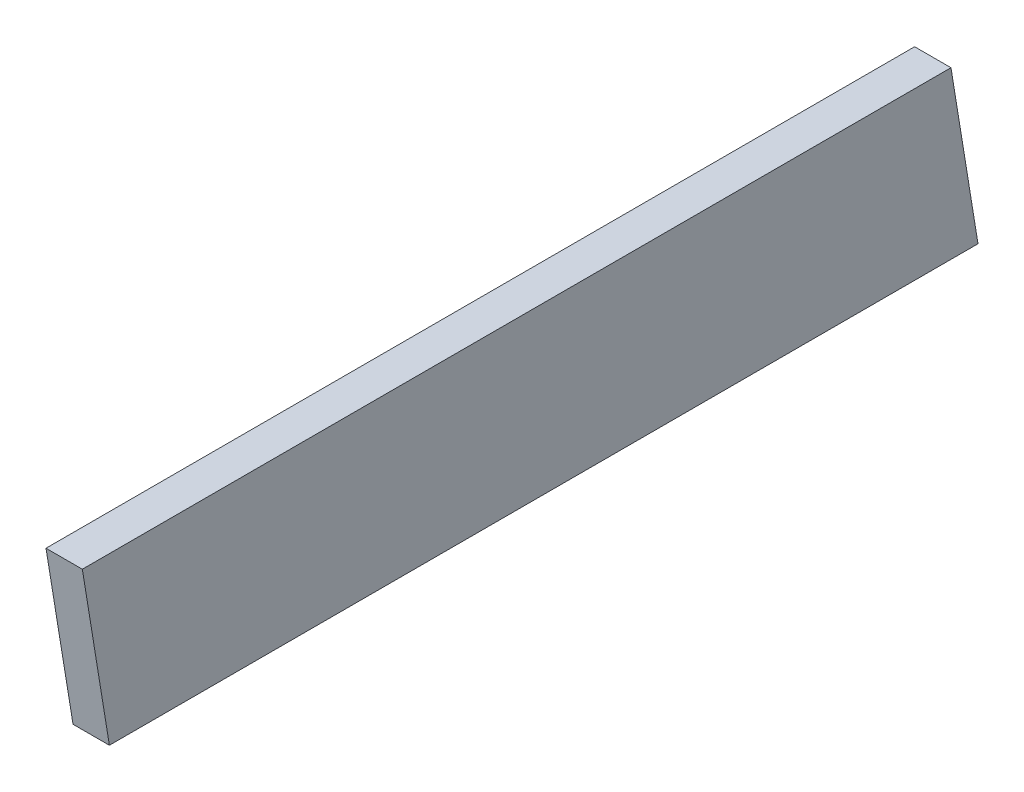
ISO-10303-21;
HEADER;
FILE_DESCRIPTION(('STEP AP214'),'2;1');
FILE_NAME('part.step','',(''),(''),'','','');
FILE_SCHEMA(('AUTOMOTIVE_DESIGN { 1 0 10303 214 1 1 1 1 }'));
ENDSEC;
DATA;
#1=APPLICATION_CONTEXT('core data for automotive mechanical design processes');
#2=APPLICATION_PROTOCOL_DEFINITION('international standard','automotive_design',2000,#1);
#3=PRODUCT_CONTEXT('',#1,'mechanical');
#4=PRODUCT('Part','Part','',(#3));
#5=PRODUCT_RELATED_PRODUCT_CATEGORY('part','',(#4));
#6=PRODUCT_DEFINITION_FORMATION('','',#4);
#7=PRODUCT_DEFINITION_CONTEXT('part definition',#1,'design');
#8=PRODUCT_DEFINITION('design','',#6,#7);
#9=PRODUCT_DEFINITION_SHAPE('','',#8);
#10=(LENGTH_UNIT() NAMED_UNIT(*) SI_UNIT(.MILLI.,.METRE.));
#11=(NAMED_UNIT(*) PLANE_ANGLE_UNIT() SI_UNIT($,.RADIAN.));
#12=(NAMED_UNIT(*) SI_UNIT($,.STERADIAN.) SOLID_ANGLE_UNIT());
#13=UNCERTAINTY_MEASURE_WITH_UNIT(LENGTH_MEASURE(1.E-05),#10,'distance_accuracy_value','');
#14=(GEOMETRIC_REPRESENTATION_CONTEXT(3) GLOBAL_UNCERTAINTY_ASSIGNED_CONTEXT((#13)) GLOBAL_UNIT_ASSIGNED_CONTEXT((#10,
#11,#12)) REPRESENTATION_CONTEXT('',''));
#15=CARTESIAN_POINT('',(0.,0.,0.));
#16=DIRECTION('',(0.,0.,1.));
#17=DIRECTION('',(1.,0.,0.));
#18=AXIS2_PLACEMENT_3D('',#15,#16,#17);
#19=CARTESIAN_POINT('',(-127.9356367578,-78.9296498973833,33.9274521196378));
#20=DIRECTION('',(0.,-1.,0.));
#21=DIRECTION('',(1.,0.,0.));
#22=AXIS2_PLACEMENT_3D('',#19,#20,#21);
#23=PLANE('',#22);
#24=DIRECTION('',(0.,0.,-1.));
#25=VECTOR('',#24,1.);
#26=CARTESIAN_POINT('',(-127.1996852462,-78.9296498973833,33.9274521196378));
#27=LINE('',#26,#25);
#28=CARTESIAN_POINT('',(-127.1996852462,-78.9296498973833,33.9274521196378));
#29=VERTEX_POINT('',#28);
#30=CARTESIAN_POINT('',(-127.1996852462,-78.9296498973833,16.3396386114468));
#31=VERTEX_POINT('',#30);
#32=EDGE_CURVE('E79',#29,#31,#27,.T.);
#33=ORIENTED_EDGE('',*,*,#32,.F.);
#34=DIRECTION('',(1.,0.,0.));
#35=VECTOR('',#34,1.);
#36=CARTESIAN_POINT('',(-127.9356367578,-78.9296498973833,33.9274521196378));
#37=LINE('',#36,#35);
#38=CARTESIAN_POINT('',(-127.9356367578,-78.9296498973833,33.9274521196378));
#39=VERTEX_POINT('',#38);
#40=EDGE_CURVE('E32',#39,#29,#37,.T.);
#41=ORIENTED_EDGE('',*,*,#40,.F.);
#42=DIRECTION('',(0.,0.,-1.));
#43=VECTOR('',#42,1.);
#44=CARTESIAN_POINT('',(-127.9356367578,-78.9296498973833,33.9274521196378));
#45=LINE('',#44,#43);
#46=CARTESIAN_POINT('',(-127.9356367578,-78.9296498973833,16.3396386114468));
#47=VERTEX_POINT('',#46);
#48=EDGE_CURVE('E71',#39,#47,#45,.T.);
#49=ORIENTED_EDGE('',*,*,#48,.T.);
#50=DIRECTION('',(1.,0.,0.));
#51=VECTOR('',#50,1.);
#52=CARTESIAN_POINT('',(-127.9356367578,-78.9296498973833,16.3396386114468));
#53=LINE('',#52,#51);
#54=EDGE_CURVE('E10',#47,#31,#53,.T.);
#55=ORIENTED_EDGE('',*,*,#54,.T.);
#56=EDGE_LOOP('',(#33,#41,#49,#55));
#57=FACE_BOUND('',#56,.T.);
#58=ADVANCED_FACE('F16',(#57),#23,.T.);
#59=CARTESIAN_POINT('',(-127.9356367578,-78.9296498973833,16.3396386114468));
#60=DIRECTION('',(0.,0.160675602081711,-0.987007269930511));
#61=DIRECTION('',(0.,0.987007269930511,0.160675602081711));
#62=AXIS2_PLACEMENT_3D('',#59,#60,#61);
#63=PLANE('',#62);
#64=DIRECTION('',(0.,0.98700726993051,0.160675602081711));
#65=VECTOR('',#64,1.);
#66=CARTESIAN_POINT('',(-127.1996852462,-78.9296498973833,16.3396386114468));
#67=LINE('',#66,#65);
#68=CARTESIAN_POINT('',(-127.1996852462,-75.5686180518089,16.8867833304937));
#69=VERTEX_POINT('',#68);
#70=EDGE_CURVE('E82',#31,#69,#67,.T.);
#71=ORIENTED_EDGE('',*,*,#70,.F.);
#72=ORIENTED_EDGE('',*,*,#54,.F.);
#73=DIRECTION('',(0.,0.98700726993051,0.160675602081711));
#74=VECTOR('',#73,1.);
#75=CARTESIAN_POINT('',(-127.9356367578,-78.9296498973833,16.3396386114468));
#76=LINE('',#75,#74);
#77=CARTESIAN_POINT('',(-127.9356367578,-75.5686180518089,16.8867833304937));
#78=VERTEX_POINT('',#77);
#79=EDGE_CURVE('E67',#47,#78,#76,.T.);
#80=ORIENTED_EDGE('',*,*,#79,.T.);
#81=DIRECTION('',(1.,0.,0.));
#82=VECTOR('',#81,1.);
#83=CARTESIAN_POINT('',(-127.9356367578,-75.5686180518089,16.8867833304937));
#84=LINE('',#83,#82);
#85=EDGE_CURVE('E24',#78,#69,#84,.T.);
#86=ORIENTED_EDGE('',*,*,#85,.T.);
#87=EDGE_LOOP('',(#71,#72,#80,#86));
#88=FACE_BOUND('',#87,.T.);
#89=ADVANCED_FACE('F68',(#88),#63,.T.);
#90=CARTESIAN_POINT('',(-127.9356367578,-75.5686180518089,16.8867833304937));
#91=DIRECTION('',(0.,1.,0.));
#92=DIRECTION('',(-1.,0.,0.));
#93=AXIS2_PLACEMENT_3D('',#90,#91,#92);
#94=PLANE('',#93);
#95=DIRECTION('',(0.,0.,1.));
#96=VECTOR('',#95,1.);
#97=CARTESIAN_POINT('',(-127.1996852462,-75.5686180518089,16.8867833304937));
#98=LINE('',#97,#96);
#99=CARTESIAN_POINT('',(-127.1996852462,-75.568618051809,34.4745968386847));
#100=VERTEX_POINT('',#99);
#101=EDGE_CURVE('E65',#69,#100,#98,.T.);
#102=ORIENTED_EDGE('',*,*,#101,.F.);
#103=ORIENTED_EDGE('',*,*,#85,.F.);
#104=DIRECTION('',(0.,0.,1.));
#105=VECTOR('',#104,1.);
#106=CARTESIAN_POINT('',(-127.9356367578,-75.5686180518089,16.8867833304937));
#107=LINE('',#106,#105);
#108=CARTESIAN_POINT('',(-127.9356367578,-75.568618051809,34.4745968386847));
#109=VERTEX_POINT('',#108);
#110=EDGE_CURVE('E62',#78,#109,#107,.T.);
#111=ORIENTED_EDGE('',*,*,#110,.T.);
#112=DIRECTION('',(1.,0.,0.));
#113=VECTOR('',#112,1.);
#114=CARTESIAN_POINT('',(-127.9356367578,-75.568618051809,34.4745968386847));
#115=LINE('',#114,#113);
#116=EDGE_CURVE('E48',#109,#100,#115,.T.);
#117=ORIENTED_EDGE('',*,*,#116,.T.);
#118=EDGE_LOOP('',(#102,#103,#111,#117));
#119=FACE_BOUND('',#118,.T.);
#120=ADVANCED_FACE('F60',(#119),#94,.T.);
#121=CARTESIAN_POINT('',(-127.9356367578,-75.568618051809,34.4745968386847));
#122=DIRECTION('',(0.,-0.160675602081711,0.987007269930511));
#123=DIRECTION('',(0.,-0.987007269930511,-0.160675602081711));
#124=AXIS2_PLACEMENT_3D('',#121,#122,#123);
#125=PLANE('',#124);
#126=DIRECTION('',(0.,-0.98700726993051,-0.160675602081711));
#127=VECTOR('',#126,1.);
#128=CARTESIAN_POINT('',(-127.1996852462,-75.568618051809,34.4745968386847));
#129=LINE('',#128,#127);
#130=EDGE_CURVE('E85',#100,#29,#129,.T.);
#131=ORIENTED_EDGE('',*,*,#130,.F.);
#132=ORIENTED_EDGE('',*,*,#116,.F.);
#133=DIRECTION('',(0.,-0.98700726993051,-0.160675602081711));
#134=VECTOR('',#133,1.);
#135=CARTESIAN_POINT('',(-127.9356367578,-75.568618051809,34.4745968386847));
#136=LINE('',#135,#134);
#137=EDGE_CURVE('E74',#109,#39,#136,.T.);
#138=ORIENTED_EDGE('',*,*,#137,.T.);
#139=ORIENTED_EDGE('',*,*,#40,.T.);
#140=EDGE_LOOP('',(#131,#132,#138,#139));
#141=FACE_BOUND('',#140,.T.);
#142=ADVANCED_FACE('F96',(#141),#125,.T.);
#143=CARTESIAN_POINT('',(-127.9356367578,-75.75,25.4883720930233));
#144=DIRECTION('',(1.,0.,0.));
#145=DIRECTION('',(0.,1.,0.));
#146=AXIS2_PLACEMENT_3D('',#143,#144,#145);
#147=PLANE('',#146);
#148=ORIENTED_EDGE('',*,*,#48,.F.);
#149=ORIENTED_EDGE('',*,*,#137,.F.);
#150=ORIENTED_EDGE('',*,*,#110,.F.);
#151=ORIENTED_EDGE('',*,*,#79,.F.);
#152=EDGE_LOOP('',(#148,#149,#150,#151));
#153=FACE_BOUND('',#152,.T.);
#154=ADVANCED_FACE('F73',(#153),#147,.F.);
#155=CARTESIAN_POINT('',(-127.1996852462,-75.75,25.4883720930233));
#156=DIRECTION('',(1.,0.,0.));
#157=DIRECTION('',(0.,1.,0.));
#158=AXIS2_PLACEMENT_3D('',#155,#156,#157);
#159=PLANE('',#158);
#160=ORIENTED_EDGE('',*,*,#32,.T.);
#161=ORIENTED_EDGE('',*,*,#70,.T.);
#162=ORIENTED_EDGE('',*,*,#101,.T.);
#163=ORIENTED_EDGE('',*,*,#130,.T.);
#164=EDGE_LOOP('',(#160,#161,#162,#163));
#165=FACE_BOUND('',#164,.T.);
#166=ADVANCED_FACE('F89',(#165),#159,.T.);
#167=CLOSED_SHELL('',(#58,#89,#120,#142,#154,#166));
#168=MANIFOLD_SOLID_BREP('B1',#167);
#169=ADVANCED_BREP_SHAPE_REPRESENTATION('',(#18,#168),#14);
#170=SHAPE_DEFINITION_REPRESENTATION(#9,#169);
ENDSEC;
END-ISO-10303-21;
